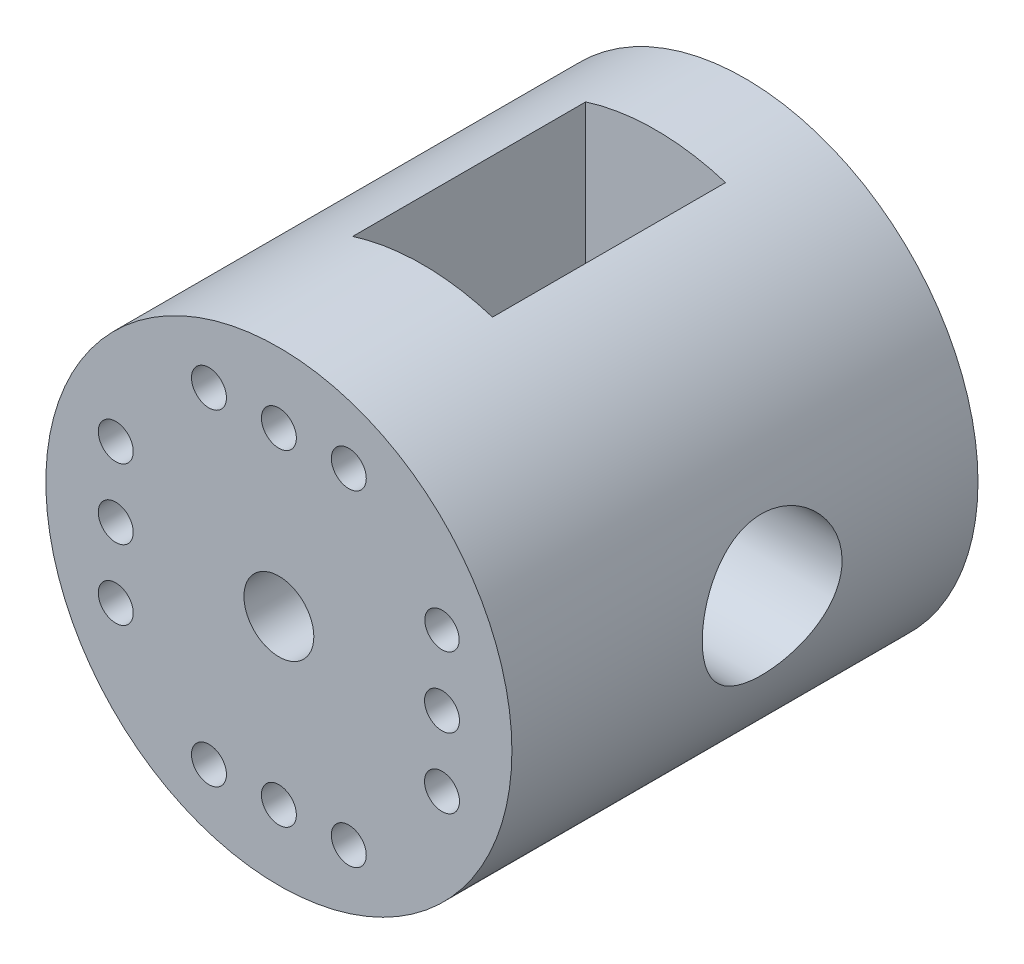
ISO-10303-21;
HEADER;
FILE_DESCRIPTION(('STEP AP214'),'2;1');
FILE_NAME('part.step','',(''),(''),'','','');
FILE_SCHEMA(('AUTOMOTIVE_DESIGN { 1 0 10303 214 1 1 1 1 }'));
ENDSEC;
DATA;
#1=APPLICATION_CONTEXT('core data for automotive mechanical design processes');
#2=APPLICATION_PROTOCOL_DEFINITION('international standard','automotive_design',2000,#1);
#3=PRODUCT_CONTEXT('',#1,'mechanical');
#4=PRODUCT('Part','Part','',(#3));
#5=PRODUCT_RELATED_PRODUCT_CATEGORY('part','',(#4));
#6=PRODUCT_DEFINITION_FORMATION('','',#4);
#7=PRODUCT_DEFINITION_CONTEXT('part definition',#1,'design');
#8=PRODUCT_DEFINITION('design','',#6,#7);
#9=PRODUCT_DEFINITION_SHAPE('','',#8);
#10=(LENGTH_UNIT() NAMED_UNIT(*) SI_UNIT(.MILLI.,.METRE.));
#11=(NAMED_UNIT(*) PLANE_ANGLE_UNIT() SI_UNIT($,.RADIAN.));
#12=(NAMED_UNIT(*) SI_UNIT($,.STERADIAN.) SOLID_ANGLE_UNIT());
#13=UNCERTAINTY_MEASURE_WITH_UNIT(LENGTH_MEASURE(1.E-05),#10,'distance_accuracy_value','');
#14=(GEOMETRIC_REPRESENTATION_CONTEXT(3) GLOBAL_UNCERTAINTY_ASSIGNED_CONTEXT((#13)) GLOBAL_UNIT_ASSIGNED_CONTEXT((#10,
#11,#12)) REPRESENTATION_CONTEXT('',''));
#15=CARTESIAN_POINT('',(0.,0.,0.));
#16=DIRECTION('',(0.,0.,1.));
#17=DIRECTION('',(1.,0.,0.));
#18=AXIS2_PLACEMENT_3D('',#15,#16,#17);
#19=CARTESIAN_POINT('',(0.,0.,5.));
#20=DIRECTION('',(0.,0.,-1.));
#21=DIRECTION('',(-1.,0.,0.));
#22=AXIS2_PLACEMENT_3D('',#19,#20,#21);
#23=CYLINDRICAL_SURFACE('',#22,9.99999999999998);
#24=DIRECTION('',(0.,0.,-1.));
#25=VECTOR('',#24,1.);
#26=CARTESIAN_POINT('',(3.,-9.53939201416944,5.));
#27=LINE('',#26,#25);
#28=CARTESIAN_POINT('',(3.,-9.53939201416944,-11.1674764110924));
#29=VERTEX_POINT('',#28);
#30=CARTESIAN_POINT('',(3.,-9.53939201416944,-1.16747641109243));
#31=VERTEX_POINT('',#30);
#32=EDGE_CURVE('E101',#29,#31,#27,.F.);
#33=ORIENTED_EDGE('',*,*,#32,.F.);
#34=CARTESIAN_POINT('',(0.,0.,-11.1674764110924));
#35=DIRECTION('',(0.,0.,1.));
#36=DIRECTION('',(1.,0.,0.));
#37=AXIS2_PLACEMENT_3D('',#34,#35,#36);
#38=CIRCLE('',#37,9.99999999999998);
#39=CARTESIAN_POINT('',(-3.,-9.53939201416944,-11.1674764110924));
#40=VERTEX_POINT('',#39);
#41=EDGE_CURVE('E99',#40,#29,#38,.T.);
#42=ORIENTED_EDGE('',*,*,#41,.F.);
#43=DIRECTION('',(0.,0.,-1.));
#44=VECTOR('',#43,1.);
#45=CARTESIAN_POINT('',(-3.,-9.53939201416944,5.));
#46=LINE('',#45,#44);
#47=CARTESIAN_POINT('',(-3.,-9.53939201416944,-1.16747641109243));
#48=VERTEX_POINT('',#47);
#49=EDGE_CURVE('E84',#48,#40,#46,.T.);
#50=ORIENTED_EDGE('',*,*,#49,.F.);
#51=CARTESIAN_POINT('',(0.,0.,-1.16747641109243));
#52=DIRECTION('',(0.,0.,-1.));
#53=DIRECTION('',(-1.,0.,0.));
#54=AXIS2_PLACEMENT_3D('',#51,#52,#53);
#55=CIRCLE('',#54,9.99999999999998);
#56=EDGE_CURVE('E79',#31,#48,#55,.T.);
#57=ORIENTED_EDGE('',*,*,#56,.F.);
#58=EDGE_LOOP('',(#33,#42,#50,#57));
#59=FACE_BOUND('',#58,.T.);
#60=CARTESIAN_POINT('',(0.,0.,5.));
#61=DIRECTION('',(0.,0.,1.));
#62=DIRECTION('',(1.,0.,0.));
#63=AXIS2_PLACEMENT_3D('',#60,#61,#62);
#64=CIRCLE('',#63,9.99999999999998);
#65=CARTESIAN_POINT('',(9.99999999999998,0.,5.));
#66=VERTEX_POINT('',#65);
#67=EDGE_CURVE('E85',#66,#66,#64,.T.);
#68=ORIENTED_EDGE('',*,*,#67,.F.);
#69=EDGE_LOOP('',(#68));
#70=FACE_BOUND('',#69,.T.);
#71=CARTESIAN_POINT('',(0.,0.,-15.));
#72=DIRECTION('',(0.,0.,1.));
#73=DIRECTION('',(1.,0.,0.));
#74=AXIS2_PLACEMENT_3D('',#71,#72,#73);
#75=CIRCLE('',#74,9.99999999999998);
#76=CARTESIAN_POINT('',(9.99999999999998,0.,-15.));
#77=VERTEX_POINT('',#76);
#78=EDGE_CURVE('E120',#77,#77,#75,.T.);
#79=ORIENTED_EDGE('',*,*,#78,.T.);
#80=EDGE_LOOP('',(#79));
#81=FACE_BOUND('',#80,.T.);
#82=DIRECTION('',(0.,0.,-1.));
#83=VECTOR('',#82,1.);
#84=CARTESIAN_POINT('',(3.,9.53939201416944,5.));
#85=LINE('',#84,#83);
#86=CARTESIAN_POINT('',(3.,9.53939201416944,-1.16747641109243));
#87=VERTEX_POINT('',#86);
#88=CARTESIAN_POINT('',(3.,9.53939201416944,-11.1674764110924));
#89=VERTEX_POINT('',#88);
#90=EDGE_CURVE('E11',#87,#89,#85,.T.);
#91=ORIENTED_EDGE('',*,*,#90,.F.);
#92=CARTESIAN_POINT('',(-3.,9.53939201416944,-1.16747641109243));
#93=VERTEX_POINT('',#92);
#94=EDGE_CURVE('E87',#93,#87,#55,.T.);
#95=ORIENTED_EDGE('',*,*,#94,.F.);
#96=DIRECTION('',(0.,0.,-1.));
#97=VECTOR('',#96,1.);
#98=CARTESIAN_POINT('',(-3.,9.53939201416944,5.));
#99=LINE('',#98,#97);
#100=CARTESIAN_POINT('',(-3.,9.53939201416944,-11.1674764110924));
#101=VERTEX_POINT('',#100);
#102=EDGE_CURVE('E93',#101,#93,#99,.F.);
#103=ORIENTED_EDGE('',*,*,#102,.F.);
#104=EDGE_CURVE('E50',#89,#101,#38,.T.);
#105=ORIENTED_EDGE('',*,*,#104,.F.);
#106=EDGE_LOOP('',(#91,#95,#103,#105));
#107=FACE_BOUND('',#106,.T.);
#108=CARTESIAN_POINT('',(9.99999999999998,0.,-3.16747641109243));
#109=CARTESIAN_POINT('',(9.99999858501099,-0.1645772255066,-3.1674784060622));
#110=CARTESIAN_POINT('',(9.99589831387906,-0.329174636703059,-3.18106413834036));
#111=CARTESIAN_POINT('',(9.9799421118738,-0.653576250609762,-3.23491911953663));
#112=CARTESIAN_POINT('',(9.96808386779382,-0.81337900882284,-3.27519632713911));
#113=CARTESIAN_POINT('',(9.93791105003671,-1.12346541550905,-3.38096844491295));
#114=CARTESIAN_POINT('',(9.91960600500849,-1.27376272879075,-3.4464261503303));
#115=CARTESIAN_POINT('',(9.87844218475289,-1.56124836210626,-3.6005485972041));
#116=CARTESIAN_POINT('',(9.85558280384132,-1.69843493493934,-3.68921642588326));
#117=CARTESIAN_POINT('',(9.80701474385546,-1.95974359436749,-3.88992442603776));
#118=CARTESIAN_POINT('',(9.78124767314071,-2.08343614248868,-4.00250966286425));
#119=CARTESIAN_POINT('',(9.73011668420883,-2.31049841846647,-4.24669487091279));
#120=CARTESIAN_POINT('',(9.70475283449001,-2.41386472654882,-4.37829803534235));
#121=CARTESIAN_POINT('',(9.65668227987542,-2.59960075447415,-4.66041791716765));
#122=CARTESIAN_POINT('',(9.63404813327747,-2.68144618044427,-4.8112933330739));
#123=CARTESIAN_POINT('',(9.5948724078806,-2.81842789549521,-5.12545491955301));
#124=CARTESIAN_POINT('',(9.57832936626619,-2.87357059839947,-5.28873809894838));
#125=CARTESIAN_POINT('',(9.55381741676867,-2.95403267365303,-5.61825694335335));
#126=CARTESIAN_POINT('',(9.54562138649065,-2.98014392469355,-5.78428189882031));
#127=CARTESIAN_POINT('',(9.53805579499532,-3.00427461229344,-6.11854272352596));
#128=CARTESIAN_POINT('',(9.5386840952114,-3.00230085522157,-6.2867780472106));
#129=CARTESIAN_POINT('',(9.54849488135554,-2.97093954399623,-6.61424422830939));
#130=CARTESIAN_POINT('',(9.55736777198279,-2.9425441052537,-6.7735809118169));
#131=CARTESIAN_POINT('',(9.58216712457247,-2.86074840854112,-7.08511598363935));
#132=CARTESIAN_POINT('',(9.59809428264699,-2.80734568283282,-7.23731366584109));
#133=CARTESIAN_POINT('',(9.63545466149944,-2.67632053307363,-7.53267711041391));
#134=CARTESIAN_POINT('',(9.65696032231902,-2.59837633869285,-7.67569057900295));
#135=CARTESIAN_POINT('',(9.70301974000127,-2.42070445177367,-7.94694045511281));
#136=CARTESIAN_POINT('',(9.7275742349398,-2.32097148005177,-8.07517326991998));
#137=CARTESIAN_POINT('',(9.77822022595873,-2.09762581531093,-8.31884879261647));
#138=CARTESIAN_POINT('',(9.80433308620994,-1.97318981493394,-8.43353373915177));
#139=CARTESIAN_POINT('',(9.85424488126515,-1.70652651862793,-8.64058437922093));
#140=CARTESIAN_POINT('',(9.87804367036818,-1.56429810372178,-8.73294866792128));
#141=CARTESIAN_POINT('',(9.92086320138939,-1.26471007668561,-8.89319625602189));
#142=CARTESIAN_POINT('',(9.93985087336626,-1.1072554994959,-8.96091144359215));
#143=CARTESIAN_POINT('',(9.97067043664442,-0.782490831207039,-9.06867559129169));
#144=CARTESIAN_POINT('',(9.98250432373997,-0.615183503179163,-9.10873226815741));
#145=CARTESIAN_POINT('',(9.99736729287075,-0.281904485336664,-9.15878076689122));
#146=CARTESIAN_POINT('',(10.0006970083558,-0.116100195202374,-9.16979958269565));
#147=CARTESIAN_POINT('',(9.99905846483518,0.214999211646766,-9.16433809966827));
#148=CARTESIAN_POINT('',(9.99409131355512,0.380294393381561,-9.14786147178954));
#149=CARTESIAN_POINT('',(9.97661393974323,0.701807210619394,-9.08870718886944));
#150=CARTESIAN_POINT('',(9.96427659598827,0.858145545228338,-9.04662963593069));
#151=CARTESIAN_POINT('',(9.93348695683068,1.16150927790904,-8.93818994553603));
#152=CARTESIAN_POINT('',(9.91503392642186,1.30853355405117,-8.87182488901671));
#153=CARTESIAN_POINT('',(9.87339308702629,1.5928743789221,-8.71497008013016));
#154=CARTESIAN_POINT('',(9.85010561659278,1.72988765239934,-8.62395772919647));
#155=CARTESIAN_POINT('',(9.80146937528703,1.9870466159603,-8.42102690298682));
#156=CARTESIAN_POINT('',(9.77612008862418,2.10718806471188,-8.30910318731713));
#157=CARTESIAN_POINT('',(9.72506343738005,2.33171489102052,-8.06270179435369));
#158=CARTESIAN_POINT('',(9.69937650065511,2.43536962463001,-7.92755265954877));
#159=CARTESIAN_POINT('',(9.65153030477947,2.61857990144313,-7.64122053306554));
#160=CARTESIAN_POINT('',(9.62937095313119,2.69813607658965,-7.49003796197667));
#161=CARTESIAN_POINT('',(9.59134379226308,2.83034694254316,-7.17641142858238));
#162=CARTESIAN_POINT('',(9.57544675673499,2.88312693874021,-7.01402403801676));
#163=CARTESIAN_POINT('',(9.55183188739735,2.96043461630306,-6.68210047323195));
#164=CARTESIAN_POINT('',(9.54411125069385,2.98497197957849,-6.51256676952635));
#165=CARTESIAN_POINT('',(9.53799944941557,3.0044396896993,-6.17875337431558));
#166=CARTESIAN_POINT('',(9.53923294700393,3.00056110615887,-6.01454910899358));
#167=CARTESIAN_POINT('',(9.54998802392187,2.9661501088861,-5.68924820429119));
#168=CARTESIAN_POINT('',(9.559509271359,2.93561876249408,-5.5281514407314));
#169=CARTESIAN_POINT('',(9.58551527389241,2.84953777608686,-5.21558561282908));
#170=CARTESIAN_POINT('',(9.60191209104932,2.79430351014248,-5.06402183637504));
#171=CARTESIAN_POINT('',(9.63980557805264,2.66063014242147,-4.77219153345098));
#172=CARTESIAN_POINT('',(9.66130322385079,2.58218659925722,-4.63192717580928));
#173=CARTESIAN_POINT('',(9.70795352855336,2.40097527610175,-4.3611501780399));
#174=CARTESIAN_POINT('',(9.73321080328578,2.29742552185996,-4.23117888857206));
#175=CARTESIAN_POINT('',(9.78402640899065,2.07034869259555,-3.99007141447625));
#176=CARTESIAN_POINT('',(9.80958481647541,1.94681643426898,-3.87894013215679));
#177=CARTESIAN_POINT('',(9.85901873141571,1.67893152436652,-3.67542958650249));
#178=CARTESIAN_POINT('',(9.8828231953142,1.53407577158122,-3.58369351738148));
#179=CARTESIAN_POINT('',(9.92521360911551,1.23028274796705,-3.42600607128434));
#180=CARTESIAN_POINT('',(9.94380199862113,1.07135210599791,-3.3600426345434));
#181=CARTESIAN_POINT('',(9.97204349938617,0.761515425310564,-3.26168585978693));
#182=CARTESIAN_POINT('',(9.98244054762138,0.611573923908468,-3.22645306532593));
#183=CARTESIAN_POINT('',(9.99641888988978,0.307760390461558,-3.17934936060927));
#184=CARTESIAN_POINT('',(10.0000013230948,0.153889019716279,-3.16747454568279));
#185=CARTESIAN_POINT('',(9.99999999999998,0.,-3.16747641109243));
#186=B_SPLINE_CURVE_WITH_KNOTS('',3,(#108,#109,#110,#111,#112,#113,#114,#115,#116,#117,#118,
#119,#120,#121,#122,#123,#124,#125,#126,#127,#128,#129,#130,#131,#132,#133,#134,#135,#136,#137,
#138,#139,#140,#141,#142,#143,#144,#145,#146,#147,#148,#149,#150,#151,#152,#153,#154,#155,#156,
#157,#158,#159,#160,#161,#162,#163,#164,#165,#166,#167,#168,#169,#170,#171,#172,#173,#174,#175,
#176,#177,#178,#179,#180,#181,#182,#183,#184,#185),.UNSPECIFIED.,.T.,.F.,(4,2,2,2,2,2,2,2,2,2,2,
2,2,2,2,2,2,2,2,2,2,2,2,2,2,2,2,2,2,2,2,2,2,2,2,2,2,2,4),(0.,0.493166407225221,
0.986479929691999,1.47906735260175,1.9717203288254,2.47711205896383,2.98258874577266,
3.49942962008218,4.01614629086447,4.51839378713198,5.02051956638179,5.50452033395352,
5.98856887316002,6.47924852894239,6.97004720317111,7.48134208096333,7.99266913062143,
8.50742093763377,9.02202907057615,9.5181761887709,10.0142570710065,10.4991349336465,
10.9840710918746,11.4802261140582,11.9765056400038,12.4908080064564,13.0050968850536,
13.516956299025,14.0286401892057,14.5190031093854,15.0093463933232,15.4936008081456,
15.9779479511534,16.4799385136898,16.9820594980412,17.4988599232246,18.0154182319959,
18.4766338387004,18.9377723390687),.UNSPECIFIED.);
#187=CARTESIAN_POINT('',(9.99999999999998,0.,-3.16747641109243));
#188=VERTEX_POINT('',#187);
#189=EDGE_CURVE('E577',#188,#188,#186,.T.);
#190=ORIENTED_EDGE('',*,*,#189,.F.);
#191=EDGE_LOOP('',(#190));
#192=FACE_BOUND('',#191,.T.);
#193=CARTESIAN_POINT('',(-9.99999999999998,0.,-3.16747641109243));
#194=CARTESIAN_POINT('',(-9.99999858501099,0.1645772255066,-3.1674784060622));
#195=CARTESIAN_POINT('',(-9.99589831387906,0.329174636703059,-3.18106413834036));
#196=CARTESIAN_POINT('',(-9.9799421118738,0.653576250609762,-3.23491911953663));
#197=CARTESIAN_POINT('',(-9.96808386779382,0.81337900882284,-3.27519632713911));
#198=CARTESIAN_POINT('',(-9.93791105003671,1.12346541550905,-3.38096844491295));
#199=CARTESIAN_POINT('',(-9.91960600500849,1.27376272879075,-3.4464261503303));
#200=CARTESIAN_POINT('',(-9.87844218475289,1.56124836210626,-3.6005485972041));
#201=CARTESIAN_POINT('',(-9.85558280384132,1.69843493493934,-3.68921642588326));
#202=CARTESIAN_POINT('',(-9.80701474385546,1.95974359436749,-3.88992442603776));
#203=CARTESIAN_POINT('',(-9.78124767314071,2.08343614248868,-4.00250966286425));
#204=CARTESIAN_POINT('',(-9.73011668420883,2.31049841846647,-4.24669487091279));
#205=CARTESIAN_POINT('',(-9.70475283449001,2.41386472654882,-4.37829803534235));
#206=CARTESIAN_POINT('',(-9.65668227987542,2.59960075447415,-4.66041791716765));
#207=CARTESIAN_POINT('',(-9.63404813327747,2.68144618044427,-4.8112933330739));
#208=CARTESIAN_POINT('',(-9.5948724078806,2.81842789549521,-5.12545491955301));
#209=CARTESIAN_POINT('',(-9.57832936626619,2.87357059839947,-5.28873809894838));
#210=CARTESIAN_POINT('',(-9.55381741676867,2.95403267365303,-5.61825694335335));
#211=CARTESIAN_POINT('',(-9.54562138649065,2.98014392469355,-5.78428189882031));
#212=CARTESIAN_POINT('',(-9.53805579499532,3.00427461229344,-6.11854272352596));
#213=CARTESIAN_POINT('',(-9.5386840952114,3.00230085522157,-6.2867780472106));
#214=CARTESIAN_POINT('',(-9.54849488135554,2.97093954399623,-6.61424422830939));
#215=CARTESIAN_POINT('',(-9.55736777198279,2.9425441052537,-6.7735809118169));
#216=CARTESIAN_POINT('',(-9.58216712457247,2.86074840854112,-7.08511598363935));
#217=CARTESIAN_POINT('',(-9.59809428264699,2.80734568283282,-7.23731366584109));
#218=CARTESIAN_POINT('',(-9.63545466149944,2.67632053307363,-7.53267711041391));
#219=CARTESIAN_POINT('',(-9.65696032231902,2.59837633869285,-7.67569057900295));
#220=CARTESIAN_POINT('',(-9.70301974000127,2.42070445177367,-7.94694045511281));
#221=CARTESIAN_POINT('',(-9.7275742349398,2.32097148005177,-8.07517326991998));
#222=CARTESIAN_POINT('',(-9.77822022595873,2.09762581531093,-8.31884879261647));
#223=CARTESIAN_POINT('',(-9.80433308620994,1.97318981493394,-8.43353373915177));
#224=CARTESIAN_POINT('',(-9.85424488126515,1.70652651862793,-8.64058437922093));
#225=CARTESIAN_POINT('',(-9.87804367036818,1.56429810372178,-8.73294866792128));
#226=CARTESIAN_POINT('',(-9.92086320138939,1.26471007668561,-8.89319625602189));
#227=CARTESIAN_POINT('',(-9.93985087336626,1.1072554994959,-8.96091144359215));
#228=CARTESIAN_POINT('',(-9.97067043664442,0.782490831207039,-9.06867559129169));
#229=CARTESIAN_POINT('',(-9.98250432373997,0.615183503179163,-9.10873226815741));
#230=CARTESIAN_POINT('',(-9.99736729287075,0.281904485336664,-9.15878076689122));
#231=CARTESIAN_POINT('',(-10.0006970083558,0.116100195202374,-9.16979958269565));
#232=CARTESIAN_POINT('',(-9.99905846483518,-0.214999211646766,-9.16433809966827));
#233=CARTESIAN_POINT('',(-9.99409131355512,-0.380294393381561,-9.14786147178954));
#234=CARTESIAN_POINT('',(-9.97661393974323,-0.701807210619394,-9.08870718886944));
#235=CARTESIAN_POINT('',(-9.96427659598827,-0.858145545228338,-9.04662963593069));
#236=CARTESIAN_POINT('',(-9.93348695683068,-1.16150927790904,-8.93818994553603));
#237=CARTESIAN_POINT('',(-9.91503392642186,-1.30853355405117,-8.87182488901671));
#238=CARTESIAN_POINT('',(-9.87339308702629,-1.5928743789221,-8.71497008013016));
#239=CARTESIAN_POINT('',(-9.85010561659278,-1.72988765239934,-8.62395772919647));
#240=CARTESIAN_POINT('',(-9.80146937528703,-1.9870466159603,-8.42102690298682));
#241=CARTESIAN_POINT('',(-9.77612008862418,-2.10718806471188,-8.30910318731713));
#242=CARTESIAN_POINT('',(-9.72506343738005,-2.33171489102052,-8.06270179435369));
#243=CARTESIAN_POINT('',(-9.69937650065511,-2.43536962463001,-7.92755265954877));
#244=CARTESIAN_POINT('',(-9.65153030477947,-2.61857990144313,-7.64122053306554));
#245=CARTESIAN_POINT('',(-9.62937095313119,-2.69813607658965,-7.49003796197667));
#246=CARTESIAN_POINT('',(-9.59134379226308,-2.83034694254316,-7.17641142858238));
#247=CARTESIAN_POINT('',(-9.57544675673499,-2.88312693874021,-7.01402403801676));
#248=CARTESIAN_POINT('',(-9.55183188739735,-2.96043461630306,-6.68210047323195));
#249=CARTESIAN_POINT('',(-9.54411125069385,-2.98497197957849,-6.51256676952635));
#250=CARTESIAN_POINT('',(-9.53799944941557,-3.0044396896993,-6.17875337431558));
#251=CARTESIAN_POINT('',(-9.53923294700393,-3.00056110615887,-6.01454910899358));
#252=CARTESIAN_POINT('',(-9.54998802392187,-2.9661501088861,-5.68924820429119));
#253=CARTESIAN_POINT('',(-9.559509271359,-2.93561876249408,-5.5281514407314));
#254=CARTESIAN_POINT('',(-9.58551527389241,-2.84953777608686,-5.21558561282908));
#255=CARTESIAN_POINT('',(-9.60191209104932,-2.79430351014248,-5.06402183637504));
#256=CARTESIAN_POINT('',(-9.63980557805264,-2.66063014242147,-4.77219153345098));
#257=CARTESIAN_POINT('',(-9.66130322385079,-2.58218659925722,-4.63192717580928));
#258=CARTESIAN_POINT('',(-9.70795352855336,-2.40097527610175,-4.3611501780399));
#259=CARTESIAN_POINT('',(-9.73321080328578,-2.29742552185996,-4.23117888857206));
#260=CARTESIAN_POINT('',(-9.78402640899065,-2.07034869259555,-3.99007141447625));
#261=CARTESIAN_POINT('',(-9.80958481647541,-1.94681643426898,-3.87894013215679));
#262=CARTESIAN_POINT('',(-9.85901873141571,-1.67893152436652,-3.67542958650249));
#263=CARTESIAN_POINT('',(-9.8828231953142,-1.53407577158122,-3.58369351738148));
#264=CARTESIAN_POINT('',(-9.92521360911551,-1.23028274796705,-3.42600607128434));
#265=CARTESIAN_POINT('',(-9.94380199862113,-1.07135210599791,-3.3600426345434));
#266=CARTESIAN_POINT('',(-9.97204349938617,-0.761515425310564,-3.26168585978693));
#267=CARTESIAN_POINT('',(-9.98244054762138,-0.611573923908468,-3.22645306532593));
#268=CARTESIAN_POINT('',(-9.99641888988978,-0.307760390461558,-3.17934936060927));
#269=CARTESIAN_POINT('',(-10.0000013230948,-0.153889019716279,-3.16747454568279));
#270=CARTESIAN_POINT('',(-9.99999999999998,0.,-3.16747641109243));
#271=B_SPLINE_CURVE_WITH_KNOTS('',3,(#193,#194,#195,#196,#197,#198,#199,#200,#201,#202,#203,
#204,#205,#206,#207,#208,#209,#210,#211,#212,#213,#214,#215,#216,#217,#218,#219,#220,#221,#222,
#223,#224,#225,#226,#227,#228,#229,#230,#231,#232,#233,#234,#235,#236,#237,#238,#239,#240,#241,
#242,#243,#244,#245,#246,#247,#248,#249,#250,#251,#252,#253,#254,#255,#256,#257,#258,#259,#260,
#261,#262,#263,#264,#265,#266,#267,#268,#269,#270),.UNSPECIFIED.,.T.,.F.,(4,2,2,2,2,2,2,2,2,2,2,
2,2,2,2,2,2,2,2,2,2,2,2,2,2,2,2,2,2,2,2,2,2,2,2,2,2,2,4),(0.,0.493166407225221,
0.986479929691999,1.47906735260175,1.9717203288254,2.47711205896383,2.98258874577266,
3.49942962008218,4.01614629086447,4.51839378713198,5.02051956638179,5.50452033395352,
5.98856887316002,6.47924852894239,6.97004720317111,7.48134208096333,7.99266913062143,
8.50742093763377,9.02202907057615,9.5181761887709,10.0142570710065,10.4991349336465,
10.9840710918746,11.4802261140582,11.9765056400038,12.4908080064564,13.0050968850536,
13.516956299025,14.0286401892057,14.5190031093854,15.0093463933232,15.4936008081456,
15.9779479511534,16.4799385136898,16.9820594980412,17.4988599232246,18.0154182319959,
18.4766338387004,18.9377723390687),.UNSPECIFIED.);
#272=CARTESIAN_POINT('',(-9.99999999999998,0.,-3.16747641109243));
#273=VERTEX_POINT('',#272);
#274=EDGE_CURVE('E112',#273,#273,#271,.T.);
#275=ORIENTED_EDGE('',*,*,#274,.F.);
#276=EDGE_LOOP('',(#275));
#277=FACE_BOUND('',#276,.T.);
#278=ADVANCED_FACE('F41',(#59,#70,#81,#107,#192,#277),#23,.T.);
#279=CARTESIAN_POINT('',(0.,0.,5.));
#280=DIRECTION('',(0.,0.,1.));
#281=DIRECTION('',(1.,0.,0.));
#282=AXIS2_PLACEMENT_3D('',#279,#280,#281);
#283=PLANE('',#282);
#284=CARTESIAN_POINT('',(0.,6.9999999999999,5.));
#285=DIRECTION('',(0.,0.,1.));
#286=DIRECTION('',(1.,0.,0.));
#287=AXIS2_PLACEMENT_3D('',#284,#285,#286);
#288=CIRCLE('',#287,0.74999999999981);
#289=CARTESIAN_POINT('',(0.74999999999981,6.9999999999999,5.));
#290=VERTEX_POINT('',#289);
#291=EDGE_CURVE('E132',#290,#290,#288,.T.);
#292=ORIENTED_EDGE('',*,*,#291,.F.);
#293=EDGE_LOOP('',(#292));
#294=FACE_BOUND('',#293,.T.);
#295=CARTESIAN_POINT('',(-7.00000000000001,2.99999999999989,5.));
#296=DIRECTION('',(0.,0.,1.));
#297=DIRECTION('',(1.,0.,0.));
#298=AXIS2_PLACEMENT_3D('',#295,#296,#297);
#299=CIRCLE('',#298,0.74999999999981);
#300=CARTESIAN_POINT('',(-6.2500000000002,2.99999999999989,5.));
#301=VERTEX_POINT('',#300);
#302=EDGE_CURVE('E144',#301,#301,#299,.T.);
#303=ORIENTED_EDGE('',*,*,#302,.F.);
#304=EDGE_LOOP('',(#303));
#305=FACE_BOUND('',#304,.T.);
#306=CARTESIAN_POINT('',(-7.00000000000001,-2.99999999999989,5.));
#307=DIRECTION('',(0.,0.,1.));
#308=DIRECTION('',(1.,0.,0.));
#309=AXIS2_PLACEMENT_3D('',#306,#307,#308);
#310=CIRCLE('',#309,0.750000000000128);
#311=CARTESIAN_POINT('',(-6.24999999999988,-2.99999999999989,5.));
#312=VERTEX_POINT('',#311);
#313=EDGE_CURVE('E156',#312,#312,#310,.T.);
#314=ORIENTED_EDGE('',*,*,#313,.F.);
#315=EDGE_LOOP('',(#314));
#316=FACE_BOUND('',#315,.T.);
#317=CARTESIAN_POINT('',(0.,-6.9999999999999,5.));
#318=DIRECTION('',(0.,0.,1.));
#319=DIRECTION('',(1.,0.,0.));
#320=AXIS2_PLACEMENT_3D('',#317,#318,#319);
#321=CIRCLE('',#320,0.750000000000022);
#322=CARTESIAN_POINT('',(0.750000000000022,-6.9999999999999,5.));
#323=VERTEX_POINT('',#322);
#324=EDGE_CURVE('E168',#323,#323,#321,.T.);
#325=ORIENTED_EDGE('',*,*,#324,.F.);
#326=EDGE_LOOP('',(#325));
#327=FACE_BOUND('',#326,.T.);
#328=CARTESIAN_POINT('',(7.00000000000001,-2.99999999999989,5.));
#329=DIRECTION('',(0.,0.,1.));
#330=DIRECTION('',(1.,0.,0.));
#331=AXIS2_PLACEMENT_3D('',#328,#329,#330);
#332=CIRCLE('',#331,0.750000000000022);
#333=CARTESIAN_POINT('',(7.75000000000003,-2.99999999999989,5.));
#334=VERTEX_POINT('',#333);
#335=EDGE_CURVE('E180',#334,#334,#332,.T.);
#336=ORIENTED_EDGE('',*,*,#335,.F.);
#337=EDGE_LOOP('',(#336));
#338=FACE_BOUND('',#337,.T.);
#339=CARTESIAN_POINT('',(7.00000000000001,2.99999999999989,5.));
#340=DIRECTION('',(0.,0.,1.));
#341=DIRECTION('',(1.,0.,0.));
#342=AXIS2_PLACEMENT_3D('',#339,#340,#341);
#343=CIRCLE('',#342,0.73664312914817);
#344=CARTESIAN_POINT('',(7.73664312914818,2.99999999999989,5.));
#345=VERTEX_POINT('',#344);
#346=EDGE_CURVE('E192',#345,#345,#343,.T.);
#347=ORIENTED_EDGE('',*,*,#346,.F.);
#348=EDGE_LOOP('',(#347));
#349=FACE_BOUND('',#348,.T.);
#350=ORIENTED_EDGE('',*,*,#67,.T.);
#351=EDGE_LOOP('',(#350));
#352=FACE_BOUND('',#351,.T.);
#353=CARTESIAN_POINT('',(0.,0.,5.));
#354=DIRECTION('',(0.,0.,1.));
#355=DIRECTION('',(1.,0.,0.));
#356=AXIS2_PLACEMENT_3D('',#353,#354,#355);
#357=CIRCLE('',#356,1.50000000000011);
#358=CARTESIAN_POINT('',(1.50000000000011,0.,5.));
#359=VERTEX_POINT('',#358);
#360=EDGE_CURVE('E198',#359,#359,#357,.T.);
#361=ORIENTED_EDGE('',*,*,#360,.F.);
#362=EDGE_LOOP('',(#361));
#363=FACE_BOUND('',#362,.T.);
#364=CARTESIAN_POINT('',(7.00000000000001,0.,5.));
#365=DIRECTION('',(0.,0.,1.));
#366=DIRECTION('',(1.,0.,0.));
#367=AXIS2_PLACEMENT_3D('',#364,#365,#366);
#368=CIRCLE('',#367,0.750000000000022);
#369=CARTESIAN_POINT('',(7.75000000000003,0.,5.));
#370=VERTEX_POINT('',#369);
#371=EDGE_CURVE('E186',#370,#370,#368,.T.);
#372=ORIENTED_EDGE('',*,*,#371,.F.);
#373=EDGE_LOOP('',(#372));
#374=FACE_BOUND('',#373,.T.);
#375=CARTESIAN_POINT('',(3.,-6.9999999999999,5.));
#376=DIRECTION('',(0.,0.,1.));
#377=DIRECTION('',(1.,0.,0.));
#378=AXIS2_PLACEMENT_3D('',#375,#376,#377);
#379=CIRCLE('',#378,0.750000000000022);
#380=CARTESIAN_POINT('',(3.75000000000002,-6.9999999999999,5.));
#381=VERTEX_POINT('',#380);
#382=EDGE_CURVE('E174',#381,#381,#379,.T.);
#383=ORIENTED_EDGE('',*,*,#382,.F.);
#384=EDGE_LOOP('',(#383));
#385=FACE_BOUND('',#384,.T.);
#386=CARTESIAN_POINT('',(-3.,-6.9999999999999,5.));
#387=DIRECTION('',(0.,0.,1.));
#388=DIRECTION('',(1.,0.,0.));
#389=AXIS2_PLACEMENT_3D('',#386,#387,#388);
#390=CIRCLE('',#389,0.750000000000022);
#391=CARTESIAN_POINT('',(-2.24999999999998,-6.9999999999999,5.));
#392=VERTEX_POINT('',#391);
#393=EDGE_CURVE('E162',#392,#392,#390,.T.);
#394=ORIENTED_EDGE('',*,*,#393,.F.);
#395=EDGE_LOOP('',(#394));
#396=FACE_BOUND('',#395,.T.);
#397=CARTESIAN_POINT('',(-7.00000000000001,0.,5.));
#398=DIRECTION('',(0.,0.,1.));
#399=DIRECTION('',(1.,0.,0.));
#400=AXIS2_PLACEMENT_3D('',#397,#398,#399);
#401=CIRCLE('',#400,0.750000000000022);
#402=CARTESIAN_POINT('',(-6.24999999999998,0.,5.));
#403=VERTEX_POINT('',#402);
#404=EDGE_CURVE('E150',#403,#403,#401,.T.);
#405=ORIENTED_EDGE('',*,*,#404,.F.);
#406=EDGE_LOOP('',(#405));
#407=FACE_BOUND('',#406,.T.);
#408=CARTESIAN_POINT('',(-3.,6.9999999999999,5.));
#409=DIRECTION('',(0.,0.,1.));
#410=DIRECTION('',(1.,0.,0.));
#411=AXIS2_PLACEMENT_3D('',#408,#409,#410);
#412=CIRCLE('',#411,0.749999999999704);
#413=CARTESIAN_POINT('',(-2.2500000000003,6.9999999999999,5.));
#414=VERTEX_POINT('',#413);
#415=EDGE_CURVE('E138',#414,#414,#412,.T.);
#416=ORIENTED_EDGE('',*,*,#415,.F.);
#417=EDGE_LOOP('',(#416));
#418=FACE_BOUND('',#417,.T.);
#419=CARTESIAN_POINT('',(3.,6.9999999999999,5.));
#420=DIRECTION('',(0.,0.,1.));
#421=DIRECTION('',(1.,0.,0.));
#422=AXIS2_PLACEMENT_3D('',#419,#420,#421);
#423=CIRCLE('',#422,0.74999999999981);
#424=CARTESIAN_POINT('',(3.74999999999981,6.9999999999999,5.));
#425=VERTEX_POINT('',#424);
#426=EDGE_CURVE('E126',#425,#425,#423,.T.);
#427=ORIENTED_EDGE('',*,*,#426,.F.);
#428=EDGE_LOOP('',(#427));
#429=FACE_BOUND('',#428,.T.);
#430=ADVANCED_FACE('F205',(#294,#305,#316,#327,#338,#349,#352,#363,#374,#385,#396,#407,#418,
#429),#283,.T.);
#431=CARTESIAN_POINT('',(0.,0.,5.));
#432=DIRECTION('',(0.,0.,-1.));
#433=DIRECTION('',(-1.,0.,0.));
#434=AXIS2_PLACEMENT_3D('',#431,#432,#433);
#435=CYLINDRICAL_SURFACE('',#434,1.50000000000011);
#436=ORIENTED_EDGE('',*,*,#360,.T.);
#437=EDGE_LOOP('',(#436));
#438=FACE_BOUND('',#437,.T.);
#439=CARTESIAN_POINT('',(0.,0.,0.));
#440=DIRECTION('',(0.,0.,1.));
#441=DIRECTION('',(1.,0.,0.));
#442=AXIS2_PLACEMENT_3D('',#439,#440,#441);
#443=CIRCLE('',#442,1.50000000000011);
#444=CARTESIAN_POINT('',(1.50000000000011,0.,0.));
#445=VERTEX_POINT('',#444);
#446=EDGE_CURVE('E195',#445,#445,#443,.T.);
#447=ORIENTED_EDGE('',*,*,#446,.F.);
#448=EDGE_LOOP('',(#447));
#449=FACE_BOUND('',#448,.T.);
#450=ADVANCED_FACE('F275',(#438,#449),#435,.F.);
#451=CARTESIAN_POINT('',(7.00000000000001,2.99999999999989,5.));
#452=DIRECTION('',(0.,0.,-1.));
#453=DIRECTION('',(-1.,0.,0.));
#454=AXIS2_PLACEMENT_3D('',#451,#452,#453);
#455=CYLINDRICAL_SURFACE('',#454,0.73664312914817);
#456=ORIENTED_EDGE('',*,*,#346,.T.);
#457=EDGE_LOOP('',(#456));
#458=FACE_BOUND('',#457,.T.);
#459=CARTESIAN_POINT('',(7.00000000000001,2.99999999999989,0.));
#460=DIRECTION('',(0.,0.,1.));
#461=DIRECTION('',(1.,0.,0.));
#462=AXIS2_PLACEMENT_3D('',#459,#460,#461);
#463=CIRCLE('',#462,0.73664312914817);
#464=CARTESIAN_POINT('',(7.73664312914818,2.99999999999989,0.));
#465=VERTEX_POINT('',#464);
#466=EDGE_CURVE('E189',#465,#465,#463,.T.);
#467=ORIENTED_EDGE('',*,*,#466,.F.);
#468=EDGE_LOOP('',(#467));
#469=FACE_BOUND('',#468,.T.);
#470=ADVANCED_FACE('F271',(#458,#469),#455,.F.);
#471=CARTESIAN_POINT('',(7.00000000000001,0.,5.));
#472=DIRECTION('',(0.,0.,-1.));
#473=DIRECTION('',(-1.,0.,0.));
#474=AXIS2_PLACEMENT_3D('',#471,#472,#473);
#475=CYLINDRICAL_SURFACE('',#474,0.750000000000022);
#476=ORIENTED_EDGE('',*,*,#371,.T.);
#477=EDGE_LOOP('',(#476));
#478=FACE_BOUND('',#477,.T.);
#479=CARTESIAN_POINT('',(7.00000000000001,0.,0.));
#480=DIRECTION('',(0.,0.,1.));
#481=DIRECTION('',(1.,0.,0.));
#482=AXIS2_PLACEMENT_3D('',#479,#480,#481);
#483=CIRCLE('',#482,0.750000000000022);
#484=CARTESIAN_POINT('',(7.75000000000003,0.,0.));
#485=VERTEX_POINT('',#484);
#486=EDGE_CURVE('E183',#485,#485,#483,.T.);
#487=ORIENTED_EDGE('',*,*,#486,.F.);
#488=EDGE_LOOP('',(#487));
#489=FACE_BOUND('',#488,.T.);
#490=ADVANCED_FACE('F267',(#478,#489),#475,.F.);
#491=CARTESIAN_POINT('',(7.00000000000001,-2.99999999999989,5.));
#492=DIRECTION('',(0.,0.,-1.));
#493=DIRECTION('',(-1.,0.,0.));
#494=AXIS2_PLACEMENT_3D('',#491,#492,#493);
#495=CYLINDRICAL_SURFACE('',#494,0.750000000000022);
#496=ORIENTED_EDGE('',*,*,#335,.T.);
#497=EDGE_LOOP('',(#496));
#498=FACE_BOUND('',#497,.T.);
#499=CARTESIAN_POINT('',(7.00000000000001,-2.99999999999989,0.));
#500=DIRECTION('',(0.,0.,1.));
#501=DIRECTION('',(1.,0.,0.));
#502=AXIS2_PLACEMENT_3D('',#499,#500,#501);
#503=CIRCLE('',#502,0.750000000000022);
#504=CARTESIAN_POINT('',(7.75000000000003,-2.99999999999989,0.));
#505=VERTEX_POINT('',#504);
#506=EDGE_CURVE('E177',#505,#505,#503,.T.);
#507=ORIENTED_EDGE('',*,*,#506,.F.);
#508=EDGE_LOOP('',(#507));
#509=FACE_BOUND('',#508,.T.);
#510=ADVANCED_FACE('F263',(#498,#509),#495,.F.);
#511=CARTESIAN_POINT('',(3.,-6.9999999999999,5.));
#512=DIRECTION('',(0.,0.,-1.));
#513=DIRECTION('',(-1.,0.,0.));
#514=AXIS2_PLACEMENT_3D('',#511,#512,#513);
#515=CYLINDRICAL_SURFACE('',#514,0.750000000000022);
#516=ORIENTED_EDGE('',*,*,#382,.T.);
#517=EDGE_LOOP('',(#516));
#518=FACE_BOUND('',#517,.T.);
#519=CARTESIAN_POINT('',(3.,-6.9999999999999,0.));
#520=DIRECTION('',(0.,0.,1.));
#521=DIRECTION('',(1.,0.,0.));
#522=AXIS2_PLACEMENT_3D('',#519,#520,#521);
#523=CIRCLE('',#522,0.750000000000022);
#524=CARTESIAN_POINT('',(3.75000000000002,-6.9999999999999,0.));
#525=VERTEX_POINT('',#524);
#526=EDGE_CURVE('E171',#525,#525,#523,.T.);
#527=ORIENTED_EDGE('',*,*,#526,.F.);
#528=EDGE_LOOP('',(#527));
#529=FACE_BOUND('',#528,.T.);
#530=ADVANCED_FACE('F259',(#518,#529),#515,.F.);
#531=CARTESIAN_POINT('',(0.,-6.9999999999999,5.));
#532=DIRECTION('',(0.,0.,-1.));
#533=DIRECTION('',(-1.,0.,0.));
#534=AXIS2_PLACEMENT_3D('',#531,#532,#533);
#535=CYLINDRICAL_SURFACE('',#534,0.750000000000022);
#536=ORIENTED_EDGE('',*,*,#324,.T.);
#537=EDGE_LOOP('',(#536));
#538=FACE_BOUND('',#537,.T.);
#539=CARTESIAN_POINT('',(0.,-6.9999999999999,0.));
#540=DIRECTION('',(0.,0.,1.));
#541=DIRECTION('',(1.,0.,0.));
#542=AXIS2_PLACEMENT_3D('',#539,#540,#541);
#543=CIRCLE('',#542,0.750000000000022);
#544=CARTESIAN_POINT('',(0.750000000000022,-6.9999999999999,0.));
#545=VERTEX_POINT('',#544);
#546=EDGE_CURVE('E165',#545,#545,#543,.T.);
#547=ORIENTED_EDGE('',*,*,#546,.F.);
#548=EDGE_LOOP('',(#547));
#549=FACE_BOUND('',#548,.T.);
#550=ADVANCED_FACE('F255',(#538,#549),#535,.F.);
#551=CARTESIAN_POINT('',(-3.,-6.9999999999999,5.));
#552=DIRECTION('',(0.,0.,-1.));
#553=DIRECTION('',(-1.,0.,0.));
#554=AXIS2_PLACEMENT_3D('',#551,#552,#553);
#555=CYLINDRICAL_SURFACE('',#554,0.750000000000022);
#556=ORIENTED_EDGE('',*,*,#393,.T.);
#557=EDGE_LOOP('',(#556));
#558=FACE_BOUND('',#557,.T.);
#559=CARTESIAN_POINT('',(-3.,-6.9999999999999,0.));
#560=DIRECTION('',(0.,0.,1.));
#561=DIRECTION('',(1.,0.,0.));
#562=AXIS2_PLACEMENT_3D('',#559,#560,#561);
#563=CIRCLE('',#562,0.750000000000022);
#564=CARTESIAN_POINT('',(-2.24999999999998,-6.9999999999999,0.));
#565=VERTEX_POINT('',#564);
#566=EDGE_CURVE('E159',#565,#565,#563,.T.);
#567=ORIENTED_EDGE('',*,*,#566,.F.);
#568=EDGE_LOOP('',(#567));
#569=FACE_BOUND('',#568,.T.);
#570=ADVANCED_FACE('F251',(#558,#569),#555,.F.);
#571=CARTESIAN_POINT('',(-7.00000000000001,-2.99999999999989,5.));
#572=DIRECTION('',(0.,0.,-1.));
#573=DIRECTION('',(-1.,0.,0.));
#574=AXIS2_PLACEMENT_3D('',#571,#572,#573);
#575=CYLINDRICAL_SURFACE('',#574,0.750000000000128);
#576=ORIENTED_EDGE('',*,*,#313,.T.);
#577=EDGE_LOOP('',(#576));
#578=FACE_BOUND('',#577,.T.);
#579=CARTESIAN_POINT('',(-7.00000000000001,-2.99999999999989,0.));
#580=DIRECTION('',(0.,0.,1.));
#581=DIRECTION('',(1.,0.,0.));
#582=AXIS2_PLACEMENT_3D('',#579,#580,#581);
#583=CIRCLE('',#582,0.750000000000128);
#584=CARTESIAN_POINT('',(-6.24999999999988,-2.99999999999989,0.));
#585=VERTEX_POINT('',#584);
#586=EDGE_CURVE('E153',#585,#585,#583,.T.);
#587=ORIENTED_EDGE('',*,*,#586,.F.);
#588=EDGE_LOOP('',(#587));
#589=FACE_BOUND('',#588,.T.);
#590=ADVANCED_FACE('F247',(#578,#589),#575,.F.);
#591=CARTESIAN_POINT('',(-7.00000000000001,0.,5.));
#592=DIRECTION('',(0.,0.,-1.));
#593=DIRECTION('',(-1.,0.,0.));
#594=AXIS2_PLACEMENT_3D('',#591,#592,#593);
#595=CYLINDRICAL_SURFACE('',#594,0.750000000000022);
#596=ORIENTED_EDGE('',*,*,#404,.T.);
#597=EDGE_LOOP('',(#596));
#598=FACE_BOUND('',#597,.T.);
#599=CARTESIAN_POINT('',(-7.00000000000001,0.,0.));
#600=DIRECTION('',(0.,0.,1.));
#601=DIRECTION('',(1.,0.,0.));
#602=AXIS2_PLACEMENT_3D('',#599,#600,#601);
#603=CIRCLE('',#602,0.750000000000022);
#604=CARTESIAN_POINT('',(-6.24999999999998,0.,0.));
#605=VERTEX_POINT('',#604);
#606=EDGE_CURVE('E147',#605,#605,#603,.T.);
#607=ORIENTED_EDGE('',*,*,#606,.F.);
#608=EDGE_LOOP('',(#607));
#609=FACE_BOUND('',#608,.T.);
#610=ADVANCED_FACE('F243',(#598,#609),#595,.F.);
#611=CARTESIAN_POINT('',(-7.00000000000001,2.99999999999989,5.));
#612=DIRECTION('',(0.,0.,-1.));
#613=DIRECTION('',(-1.,0.,0.));
#614=AXIS2_PLACEMENT_3D('',#611,#612,#613);
#615=CYLINDRICAL_SURFACE('',#614,0.74999999999981);
#616=ORIENTED_EDGE('',*,*,#302,.T.);
#617=EDGE_LOOP('',(#616));
#618=FACE_BOUND('',#617,.T.);
#619=CARTESIAN_POINT('',(-7.00000000000001,2.99999999999989,0.));
#620=DIRECTION('',(0.,0.,1.));
#621=DIRECTION('',(1.,0.,0.));
#622=AXIS2_PLACEMENT_3D('',#619,#620,#621);
#623=CIRCLE('',#622,0.74999999999981);
#624=CARTESIAN_POINT('',(-6.2500000000002,2.99999999999989,0.));
#625=VERTEX_POINT('',#624);
#626=EDGE_CURVE('E141',#625,#625,#623,.T.);
#627=ORIENTED_EDGE('',*,*,#626,.F.);
#628=EDGE_LOOP('',(#627));
#629=FACE_BOUND('',#628,.T.);
#630=ADVANCED_FACE('F239',(#618,#629),#615,.F.);
#631=CARTESIAN_POINT('',(-3.,6.9999999999999,5.));
#632=DIRECTION('',(0.,0.,-1.));
#633=DIRECTION('',(-1.,0.,0.));
#634=AXIS2_PLACEMENT_3D('',#631,#632,#633);
#635=CYLINDRICAL_SURFACE('',#634,0.749999999999704);
#636=ORIENTED_EDGE('',*,*,#415,.T.);
#637=EDGE_LOOP('',(#636));
#638=FACE_BOUND('',#637,.T.);
#639=CARTESIAN_POINT('',(-3.,6.9999999999999,0.));
#640=DIRECTION('',(0.,0.,1.));
#641=DIRECTION('',(1.,0.,0.));
#642=AXIS2_PLACEMENT_3D('',#639,#640,#641);
#643=CIRCLE('',#642,0.749999999999704);
#644=CARTESIAN_POINT('',(-2.2500000000003,6.9999999999999,0.));
#645=VERTEX_POINT('',#644);
#646=EDGE_CURVE('E135',#645,#645,#643,.T.);
#647=ORIENTED_EDGE('',*,*,#646,.F.);
#648=EDGE_LOOP('',(#647));
#649=FACE_BOUND('',#648,.T.);
#650=ADVANCED_FACE('F235',(#638,#649),#635,.F.);
#651=CARTESIAN_POINT('',(0.,6.9999999999999,5.));
#652=DIRECTION('',(0.,0.,-1.));
#653=DIRECTION('',(-1.,0.,0.));
#654=AXIS2_PLACEMENT_3D('',#651,#652,#653);
#655=CYLINDRICAL_SURFACE('',#654,0.74999999999981);
#656=ORIENTED_EDGE('',*,*,#291,.T.);
#657=EDGE_LOOP('',(#656));
#658=FACE_BOUND('',#657,.T.);
#659=CARTESIAN_POINT('',(0.,6.9999999999999,0.));
#660=DIRECTION('',(0.,0.,1.));
#661=DIRECTION('',(1.,0.,0.));
#662=AXIS2_PLACEMENT_3D('',#659,#660,#661);
#663=CIRCLE('',#662,0.74999999999981);
#664=CARTESIAN_POINT('',(0.74999999999981,6.9999999999999,0.));
#665=VERTEX_POINT('',#664);
#666=EDGE_CURVE('E129',#665,#665,#663,.T.);
#667=ORIENTED_EDGE('',*,*,#666,.F.);
#668=EDGE_LOOP('',(#667));
#669=FACE_BOUND('',#668,.T.);
#670=ADVANCED_FACE('F231',(#658,#669),#655,.F.);
#671=CARTESIAN_POINT('',(3.,6.9999999999999,5.));
#672=DIRECTION('',(0.,0.,-1.));
#673=DIRECTION('',(-1.,0.,0.));
#674=AXIS2_PLACEMENT_3D('',#671,#672,#673);
#675=CYLINDRICAL_SURFACE('',#674,0.74999999999981);
#676=ORIENTED_EDGE('',*,*,#426,.T.);
#677=EDGE_LOOP('',(#676));
#678=FACE_BOUND('',#677,.T.);
#679=CARTESIAN_POINT('',(3.,6.9999999999999,0.));
#680=DIRECTION('',(0.,0.,1.));
#681=DIRECTION('',(1.,0.,0.));
#682=AXIS2_PLACEMENT_3D('',#679,#680,#681);
#683=CIRCLE('',#682,0.74999999999981);
#684=CARTESIAN_POINT('',(3.74999999999981,6.9999999999999,0.));
#685=VERTEX_POINT('',#684);
#686=EDGE_CURVE('E125',#685,#685,#683,.T.);
#687=ORIENTED_EDGE('',*,*,#686,.F.);
#688=EDGE_LOOP('',(#687));
#689=FACE_BOUND('',#688,.T.);
#690=ADVANCED_FACE('F228',(#678,#689),#675,.F.);
#691=CARTESIAN_POINT('',(0.,0.,0.));
#692=DIRECTION('',(0.,0.,1.));
#693=DIRECTION('',(1.,0.,0.));
#694=AXIS2_PLACEMENT_3D('',#691,#692,#693);
#695=PLANE('',#694);
#696=ORIENTED_EDGE('',*,*,#686,.T.);
#697=EDGE_LOOP('',(#696));
#698=FACE_BOUND('',#697,.T.);
#699=ADVANCED_FACE('F225',(#698),#695,.T.);
#700=ORIENTED_EDGE('',*,*,#666,.T.);
#701=EDGE_LOOP('',(#700));
#702=FACE_BOUND('',#701,.T.);
#703=ADVANCED_FACE('F356',(#702),#695,.T.);
#704=ORIENTED_EDGE('',*,*,#646,.T.);
#705=EDGE_LOOP('',(#704));
#706=FACE_BOUND('',#705,.T.);
#707=ADVANCED_FACE('F349',(#706),#695,.T.);
#708=ORIENTED_EDGE('',*,*,#626,.T.);
#709=EDGE_LOOP('',(#708));
#710=FACE_BOUND('',#709,.T.);
#711=ADVANCED_FACE('F342',(#710),#695,.T.);
#712=ORIENTED_EDGE('',*,*,#606,.T.);
#713=EDGE_LOOP('',(#712));
#714=FACE_BOUND('',#713,.T.);
#715=ADVANCED_FACE('F335',(#714),#695,.T.);
#716=ORIENTED_EDGE('',*,*,#586,.T.);
#717=EDGE_LOOP('',(#716));
#718=FACE_BOUND('',#717,.T.);
#719=ADVANCED_FACE('F328',(#718),#695,.T.);
#720=ORIENTED_EDGE('',*,*,#566,.T.);
#721=EDGE_LOOP('',(#720));
#722=FACE_BOUND('',#721,.T.);
#723=ADVANCED_FACE('F321',(#722),#695,.T.);
#724=ORIENTED_EDGE('',*,*,#546,.T.);
#725=EDGE_LOOP('',(#724));
#726=FACE_BOUND('',#725,.T.);
#727=ADVANCED_FACE('F314',(#726),#695,.T.);
#728=ORIENTED_EDGE('',*,*,#526,.T.);
#729=EDGE_LOOP('',(#728));
#730=FACE_BOUND('',#729,.T.);
#731=ADVANCED_FACE('F307',(#730),#695,.T.);
#732=ORIENTED_EDGE('',*,*,#506,.T.);
#733=EDGE_LOOP('',(#732));
#734=FACE_BOUND('',#733,.T.);
#735=ADVANCED_FACE('F302',(#734),#695,.T.);
#736=ORIENTED_EDGE('',*,*,#486,.T.);
#737=EDGE_LOOP('',(#736));
#738=FACE_BOUND('',#737,.T.);
#739=ADVANCED_FACE('F298',(#738),#695,.T.);
#740=ORIENTED_EDGE('',*,*,#466,.T.);
#741=EDGE_LOOP('',(#740));
#742=FACE_BOUND('',#741,.T.);
#743=ADVANCED_FACE('F222',(#742),#695,.T.);
#744=ORIENTED_EDGE('',*,*,#446,.T.);
#745=EDGE_LOOP('',(#744));
#746=FACE_BOUND('',#745,.T.);
#747=ADVANCED_FACE('F213',(#746),#695,.T.);
#748=CARTESIAN_POINT('',(0.,0.,-15.));
#749=DIRECTION('',(0.,0.,1.));
#750=DIRECTION('',(1.,0.,0.));
#751=AXIS2_PLACEMENT_3D('',#748,#749,#750);
#752=PLANE('',#751);
#753=ORIENTED_EDGE('',*,*,#78,.F.);
#754=EDGE_LOOP('',(#753));
#755=FACE_BOUND('',#754,.T.);
#756=ADVANCED_FACE('F211',(#755),#752,.F.);
#757=CARTESIAN_POINT('',(3.,20.,-11.1674764110924));
#758=DIRECTION('',(-1.,0.,0.));
#759=DIRECTION('',(0.,0.,1.));
#760=AXIS2_PLACEMENT_3D('',#757,#758,#759);
#761=PLANE('',#760);
#762=CARTESIAN_POINT('',(3.,0.,-6.16747641109243));
#763=DIRECTION('',(-1.,0.,0.));
#764=DIRECTION('',(0.,0.,1.));
#765=AXIS2_PLACEMENT_3D('',#762,#763,#764);
#766=CIRCLE('',#765,3.);
#767=CARTESIAN_POINT('',(3.,0.,-3.16747641109243));
#768=VERTEX_POINT('',#767);
#769=EDGE_CURVE('E590',#768,#768,#766,.F.);
#770=ORIENTED_EDGE('',*,*,#769,.T.);
#771=EDGE_LOOP('',(#770));
#772=FACE_BOUND('',#771,.T.);
#773=ORIENTED_EDGE('',*,*,#90,.T.);
#774=DIRECTION('',(0.,-1.,0.));
#775=VECTOR('',#774,1.);
#776=CARTESIAN_POINT('',(3.,20.,-11.1674764110924));
#777=LINE('',#776,#775);
#778=EDGE_CURVE('E118',#89,#29,#777,.T.);
#779=ORIENTED_EDGE('',*,*,#778,.T.);
#780=ORIENTED_EDGE('',*,*,#32,.T.);
#781=DIRECTION('',(0.,-1.,0.));
#782=VECTOR('',#781,1.);
#783=CARTESIAN_POINT('',(3.,20.,-1.16747641109243));
#784=LINE('',#783,#782);
#785=EDGE_CURVE('E62',#87,#31,#784,.T.);
#786=ORIENTED_EDGE('',*,*,#785,.F.);
#787=EDGE_LOOP('',(#773,#779,#780,#786));
#788=FACE_BOUND('',#787,.T.);
#789=ADVANCED_FACE('F109',(#772,#788),#761,.T.);
#790=CARTESIAN_POINT('',(-3.,20.,-11.1674764110924));
#791=DIRECTION('',(0.,0.,1.));
#792=DIRECTION('',(1.,0.,0.));
#793=AXIS2_PLACEMENT_3D('',#790,#791,#792);
#794=PLANE('',#793);
#795=ORIENTED_EDGE('',*,*,#104,.T.);
#796=DIRECTION('',(0.,-1.,0.));
#797=VECTOR('',#796,1.);
#798=CARTESIAN_POINT('',(-3.,20.,-11.1674764110924));
#799=LINE('',#798,#797);
#800=EDGE_CURVE('E95',#101,#40,#799,.T.);
#801=ORIENTED_EDGE('',*,*,#800,.T.);
#802=ORIENTED_EDGE('',*,*,#41,.T.);
#803=ORIENTED_EDGE('',*,*,#778,.F.);
#804=EDGE_LOOP('',(#795,#801,#802,#803));
#805=FACE_BOUND('',#804,.T.);
#806=ADVANCED_FACE('F117',(#805),#794,.T.);
#807=CARTESIAN_POINT('',(-3.,20.,-11.1674764110924));
#808=DIRECTION('',(1.,0.,0.));
#809=DIRECTION('',(0.,0.,-1.));
#810=AXIS2_PLACEMENT_3D('',#807,#808,#809);
#811=PLANE('',#810);
#812=CARTESIAN_POINT('',(-3.,0.,-6.16747641109243));
#813=DIRECTION('',(1.,0.,0.));
#814=DIRECTION('',(0.,0.,-1.));
#815=AXIS2_PLACEMENT_3D('',#812,#813,#814);
#816=CIRCLE('',#815,3.);
#817=CARTESIAN_POINT('',(-3.,0.,-9.16747641109243));
#818=VERTEX_POINT('',#817);
#819=EDGE_CURVE('E45',#818,#818,#816,.F.);
#820=ORIENTED_EDGE('',*,*,#819,.T.);
#821=EDGE_LOOP('',(#820));
#822=FACE_BOUND('',#821,.T.);
#823=ORIENTED_EDGE('',*,*,#49,.T.);
#824=ORIENTED_EDGE('',*,*,#800,.F.);
#825=ORIENTED_EDGE('',*,*,#102,.T.);
#826=DIRECTION('',(0.,-1.,0.));
#827=VECTOR('',#826,1.);
#828=CARTESIAN_POINT('',(-3.,20.,-1.16747641109243));
#829=LINE('',#828,#827);
#830=EDGE_CURVE('E57',#93,#48,#829,.T.);
#831=ORIENTED_EDGE('',*,*,#830,.T.);
#832=EDGE_LOOP('',(#823,#824,#825,#831));
#833=FACE_BOUND('',#832,.T.);
#834=ADVANCED_FACE('F89',(#822,#833),#811,.T.);
#835=CARTESIAN_POINT('',(-3.,20.,-1.16747641109243));
#836=DIRECTION('',(0.,0.,-1.));
#837=DIRECTION('',(-1.,0.,0.));
#838=AXIS2_PLACEMENT_3D('',#835,#836,#837);
#839=PLANE('',#838);
#840=ORIENTED_EDGE('',*,*,#94,.T.);
#841=ORIENTED_EDGE('',*,*,#785,.T.);
#842=ORIENTED_EDGE('',*,*,#56,.T.);
#843=ORIENTED_EDGE('',*,*,#830,.F.);
#844=EDGE_LOOP('',(#840,#841,#842,#843));
#845=FACE_BOUND('',#844,.T.);
#846=ADVANCED_FACE('F80',(#845),#839,.T.);
#847=CARTESIAN_POINT('',(20.,0.,-6.16747641109243));
#848=DIRECTION('',(-1.,0.,0.));
#849=DIRECTION('',(0.,0.,1.));
#850=AXIS2_PLACEMENT_3D('',#847,#848,#849);
#851=CYLINDRICAL_SURFACE('',#850,3.);
#852=ORIENTED_EDGE('',*,*,#819,.F.);
#853=EDGE_LOOP('',(#852));
#854=FACE_BOUND('',#853,.T.);
#855=ORIENTED_EDGE('',*,*,#274,.T.);
#856=EDGE_LOOP('',(#855));
#857=FACE_BOUND('',#856,.T.);
#858=ADVANCED_FACE('F538',(#854,#857),#851,.F.);
#859=ORIENTED_EDGE('',*,*,#769,.F.);
#860=EDGE_LOOP('',(#859));
#861=FACE_BOUND('',#860,.T.);
#862=ORIENTED_EDGE('',*,*,#189,.T.);
#863=EDGE_LOOP('',(#862));
#864=FACE_BOUND('',#863,.T.);
#865=ADVANCED_FACE('F552',(#861,#864),#851,.F.);
#866=CLOSED_SHELL('',(#278,#430,#450,#470,#490,#510,#530,#550,#570,#590,#610,#630,#650,#670,
#690,#699,#703,#707,#711,#715,#719,#723,#727,#731,#735,#739,#743,#747,#756,#789,#806,#834,#846,
#858,#865));
#867=MANIFOLD_SOLID_BREP('B2',#866);
#868=ADVANCED_BREP_SHAPE_REPRESENTATION('',(#18,#867),#14);
#869=SHAPE_DEFINITION_REPRESENTATION(#9,#868);
ENDSEC;
END-ISO-10303-21;
